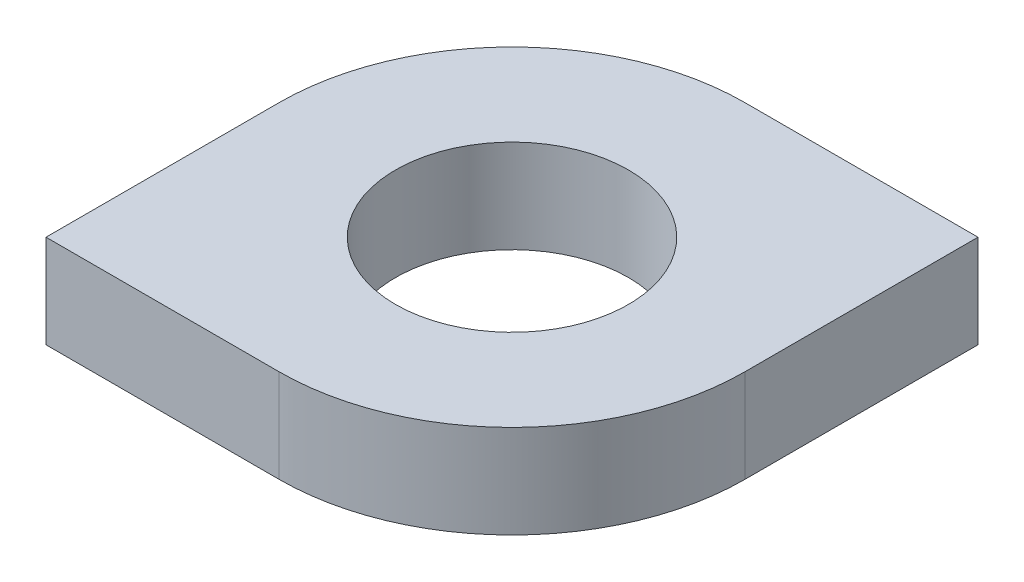
ISO-10303-21;
HEADER;
FILE_DESCRIPTION(('STEP AP214'),'2;1');
FILE_NAME('part.step','',(''),(''),'','','');
FILE_SCHEMA(('AUTOMOTIVE_DESIGN { 1 0 10303 214 1 1 1 1 }'));
ENDSEC;
DATA;
#1=APPLICATION_CONTEXT('core data for automotive mechanical design processes');
#2=APPLICATION_PROTOCOL_DEFINITION('international standard','automotive_design',2000,#1);
#3=PRODUCT_CONTEXT('',#1,'mechanical');
#4=PRODUCT('Part','Part','',(#3));
#5=PRODUCT_RELATED_PRODUCT_CATEGORY('part','',(#4));
#6=PRODUCT_DEFINITION_FORMATION('','',#4);
#7=PRODUCT_DEFINITION_CONTEXT('part definition',#1,'design');
#8=PRODUCT_DEFINITION('design','',#6,#7);
#9=PRODUCT_DEFINITION_SHAPE('','',#8);
#10=(LENGTH_UNIT() NAMED_UNIT(*) SI_UNIT(.MILLI.,.METRE.));
#11=(NAMED_UNIT(*) PLANE_ANGLE_UNIT() SI_UNIT($,.RADIAN.));
#12=(NAMED_UNIT(*) SI_UNIT($,.STERADIAN.) SOLID_ANGLE_UNIT());
#13=UNCERTAINTY_MEASURE_WITH_UNIT(LENGTH_MEASURE(1.E-05),#10,'distance_accuracy_value','');
#14=(GEOMETRIC_REPRESENTATION_CONTEXT(3) GLOBAL_UNCERTAINTY_ASSIGNED_CONTEXT((#13)) GLOBAL_UNIT_ASSIGNED_CONTEXT((#10,
#11,#12)) REPRESENTATION_CONTEXT('',''));
#15=CARTESIAN_POINT('',(0.,0.,0.));
#16=DIRECTION('',(0.,0.,1.));
#17=DIRECTION('',(1.,0.,0.));
#18=AXIS2_PLACEMENT_3D('',#15,#16,#17);
#19=CARTESIAN_POINT('',(0.,4.,-9.99999999999993));
#20=DIRECTION('',(1.,0.,0.));
#21=DIRECTION('',(0.,0.,-1.));
#22=AXIS2_PLACEMENT_3D('',#19,#20,#21);
#23=PLANE('',#22);
#24=DIRECTION('',(0.,0.,1.));
#25=VECTOR('',#24,1.);
#26=CARTESIAN_POINT('',(0.,0.,-9.99999999999993));
#27=LINE('',#26,#25);
#28=CARTESIAN_POINT('',(0.,0.,-9.99999999999993));
#29=VERTEX_POINT('',#28);
#30=CARTESIAN_POINT('',(0.,0.,0.));
#31=VERTEX_POINT('',#30);
#32=EDGE_CURVE('E118',#29,#31,#27,.T.);
#33=ORIENTED_EDGE('',*,*,#32,.T.);
#34=DIRECTION('',(0.,-1.,0.));
#35=VECTOR('',#34,1.);
#36=CARTESIAN_POINT('',(0.,4.,0.));
#37=LINE('',#36,#35);
#38=CARTESIAN_POINT('',(0.,4.,0.));
#39=VERTEX_POINT('',#38);
#40=EDGE_CURVE('E11',#39,#31,#37,.T.);
#41=ORIENTED_EDGE('',*,*,#40,.F.);
#42=DIRECTION('',(0.,0.,1.));
#43=VECTOR('',#42,1.);
#44=CARTESIAN_POINT('',(0.,4.,-9.99999999999993));
#45=LINE('',#44,#43);
#46=CARTESIAN_POINT('',(0.,4.,-9.99999999999993));
#47=VERTEX_POINT('',#46);
#48=EDGE_CURVE('E129',#47,#39,#45,.T.);
#49=ORIENTED_EDGE('',*,*,#48,.F.);
#50=DIRECTION('',(0.,-1.,0.));
#51=VECTOR('',#50,1.);
#52=CARTESIAN_POINT('',(0.,4.,-9.99999999999993));
#53=LINE('',#52,#51);
#54=EDGE_CURVE('E114',#47,#29,#53,.T.);
#55=ORIENTED_EDGE('',*,*,#54,.T.);
#56=EDGE_LOOP('',(#33,#41,#49,#55));
#57=FACE_BOUND('',#56,.T.);
#58=ADVANCED_FACE('F34',(#57),#23,.F.);
#59=CARTESIAN_POINT('',(0.,4.,0.));
#60=DIRECTION('',(0.,0.,-1.));
#61=DIRECTION('',(-1.,0.,0.));
#62=AXIS2_PLACEMENT_3D('',#59,#60,#61);
#63=PLANE('',#62);
#64=DIRECTION('',(1.,0.,0.));
#65=VECTOR('',#64,1.);
#66=CARTESIAN_POINT('',(0.,0.,0.));
#67=LINE('',#66,#65);
#68=CARTESIAN_POINT('',(9.99999999999993,0.,0.));
#69=VERTEX_POINT('',#68);
#70=EDGE_CURVE('E121',#31,#69,#67,.T.);
#71=ORIENTED_EDGE('',*,*,#70,.T.);
#72=DIRECTION('',(0.,-1.,0.));
#73=VECTOR('',#72,1.);
#74=CARTESIAN_POINT('',(9.99999999999993,4.,0.));
#75=LINE('',#74,#73);
#76=CARTESIAN_POINT('',(9.99999999999993,4.,0.));
#77=VERTEX_POINT('',#76);
#78=EDGE_CURVE('E42',#77,#69,#75,.T.);
#79=ORIENTED_EDGE('',*,*,#78,.F.);
#80=DIRECTION('',(1.,0.,0.));
#81=VECTOR('',#80,1.);
#82=CARTESIAN_POINT('',(0.,4.,0.));
#83=LINE('',#82,#81);
#84=EDGE_CURVE('E87',#39,#77,#83,.T.);
#85=ORIENTED_EDGE('',*,*,#84,.F.);
#86=ORIENTED_EDGE('',*,*,#40,.T.);
#87=EDGE_LOOP('',(#71,#79,#85,#86));
#88=FACE_BOUND('',#87,.T.);
#89=ADVANCED_FACE('F154',(#88),#63,.F.);
#90=CARTESIAN_POINT('',(10.,4.,-10.));
#91=DIRECTION('',(0.,-1.,0.));
#92=DIRECTION('',(0.,0.,-1.));
#93=AXIS2_PLACEMENT_3D('',#90,#91,#92);
#94=CYLINDRICAL_SURFACE('',#93,10.);
#95=CARTESIAN_POINT('',(10.,0.,-10.));
#96=DIRECTION('',(0.,1.,0.));
#97=DIRECTION('',(0.,0.,1.));
#98=AXIS2_PLACEMENT_3D('',#95,#96,#97);
#99=CIRCLE('',#98,10.);
#100=CARTESIAN_POINT('',(20.,0.,-10.0000000000001));
#101=VERTEX_POINT('',#100);
#102=EDGE_CURVE('E124',#69,#101,#99,.T.);
#103=ORIENTED_EDGE('',*,*,#102,.T.);
#104=DIRECTION('',(0.,-1.,0.));
#105=VECTOR('',#104,1.);
#106=CARTESIAN_POINT('',(20.,4.,-10.0000000000001));
#107=LINE('',#106,#105);
#108=CARTESIAN_POINT('',(20.,4.,-10.0000000000001));
#109=VERTEX_POINT('',#108);
#110=EDGE_CURVE('E109',#109,#101,#107,.T.);
#111=ORIENTED_EDGE('',*,*,#110,.F.);
#112=CARTESIAN_POINT('',(10.,4.,-10.));
#113=DIRECTION('',(0.,1.,0.));
#114=DIRECTION('',(0.,0.,1.));
#115=AXIS2_PLACEMENT_3D('',#112,#113,#114);
#116=CIRCLE('',#115,10.);
#117=EDGE_CURVE('E100',#77,#109,#116,.T.);
#118=ORIENTED_EDGE('',*,*,#117,.F.);
#119=ORIENTED_EDGE('',*,*,#78,.T.);
#120=EDGE_LOOP('',(#103,#111,#118,#119));
#121=FACE_BOUND('',#120,.T.);
#122=ADVANCED_FACE('F135',(#121),#94,.T.);
#123=CARTESIAN_POINT('',(20.,4.,-10.0000000000001));
#124=DIRECTION('',(-1.,0.,0.));
#125=DIRECTION('',(0.,0.,1.));
#126=AXIS2_PLACEMENT_3D('',#123,#124,#125);
#127=PLANE('',#126);
#128=DIRECTION('',(0.,0.,-1.));
#129=VECTOR('',#128,1.);
#130=CARTESIAN_POINT('',(20.,0.,-10.0000000000001));
#131=LINE('',#130,#129);
#132=CARTESIAN_POINT('',(20.,0.,-20.));
#133=VERTEX_POINT('',#132);
#134=EDGE_CURVE('E108',#101,#133,#131,.T.);
#135=ORIENTED_EDGE('',*,*,#134,.T.);
#136=DIRECTION('',(0.,-1.,0.));
#137=VECTOR('',#136,1.);
#138=CARTESIAN_POINT('',(20.,4.,-20.));
#139=LINE('',#138,#137);
#140=CARTESIAN_POINT('',(20.,4.,-20.));
#141=VERTEX_POINT('',#140);
#142=EDGE_CURVE('E105',#141,#133,#139,.T.);
#143=ORIENTED_EDGE('',*,*,#142,.F.);
#144=DIRECTION('',(0.,0.,-1.));
#145=VECTOR('',#144,1.);
#146=CARTESIAN_POINT('',(20.,4.,-10.0000000000001));
#147=LINE('',#146,#145);
#148=EDGE_CURVE('E94',#109,#141,#147,.T.);
#149=ORIENTED_EDGE('',*,*,#148,.F.);
#150=ORIENTED_EDGE('',*,*,#110,.T.);
#151=EDGE_LOOP('',(#135,#143,#149,#150));
#152=FACE_BOUND('',#151,.T.);
#153=ADVANCED_FACE('F106',(#152),#127,.F.);
#154=CARTESIAN_POINT('',(20.,4.,-20.));
#155=DIRECTION('',(0.,0.,1.));
#156=DIRECTION('',(1.,0.,0.));
#157=AXIS2_PLACEMENT_3D('',#154,#155,#156);
#158=PLANE('',#157);
#159=DIRECTION('',(-1.,0.,0.));
#160=VECTOR('',#159,1.);
#161=CARTESIAN_POINT('',(20.,0.,-20.));
#162=LINE('',#161,#160);
#163=CARTESIAN_POINT('',(10.0000000000001,0.,-20.));
#164=VERTEX_POINT('',#163);
#165=EDGE_CURVE('E73',#133,#164,#162,.T.);
#166=ORIENTED_EDGE('',*,*,#165,.T.);
#167=DIRECTION('',(0.,-1.,0.));
#168=VECTOR('',#167,1.);
#169=CARTESIAN_POINT('',(10.0000000000001,4.,-20.));
#170=LINE('',#169,#168);
#171=CARTESIAN_POINT('',(10.0000000000001,4.,-20.));
#172=VERTEX_POINT('',#171);
#173=EDGE_CURVE('E110',#172,#164,#170,.T.);
#174=ORIENTED_EDGE('',*,*,#173,.F.);
#175=DIRECTION('',(-1.,0.,0.));
#176=VECTOR('',#175,1.);
#177=CARTESIAN_POINT('',(20.,4.,-20.));
#178=LINE('',#177,#176);
#179=EDGE_CURVE('E98',#141,#172,#178,.T.);
#180=ORIENTED_EDGE('',*,*,#179,.F.);
#181=ORIENTED_EDGE('',*,*,#142,.T.);
#182=EDGE_LOOP('',(#166,#174,#180,#181));
#183=FACE_BOUND('',#182,.T.);
#184=ADVANCED_FACE('F112',(#183),#158,.F.);
#185=CARTESIAN_POINT('',(10.,4.,-10.));
#186=DIRECTION('',(0.,-1.,0.));
#187=DIRECTION('',(0.,0.,-1.));
#188=AXIS2_PLACEMENT_3D('',#185,#186,#187);
#189=CYLINDRICAL_SURFACE('',#188,10.);
#190=CARTESIAN_POINT('',(10.,0.,-10.));
#191=DIRECTION('',(0.,1.,0.));
#192=DIRECTION('',(0.,0.,1.));
#193=AXIS2_PLACEMENT_3D('',#190,#191,#192);
#194=CIRCLE('',#193,10.);
#195=EDGE_CURVE('E79',#164,#29,#194,.T.);
#196=ORIENTED_EDGE('',*,*,#195,.T.);
#197=ORIENTED_EDGE('',*,*,#54,.F.);
#198=CARTESIAN_POINT('',(10.,4.,-10.));
#199=DIRECTION('',(0.,1.,0.));
#200=DIRECTION('',(0.,0.,1.));
#201=AXIS2_PLACEMENT_3D('',#198,#199,#200);
#202=CIRCLE('',#201,10.);
#203=EDGE_CURVE('E50',#172,#47,#202,.T.);
#204=ORIENTED_EDGE('',*,*,#203,.F.);
#205=ORIENTED_EDGE('',*,*,#173,.T.);
#206=EDGE_LOOP('',(#196,#197,#204,#205));
#207=FACE_BOUND('',#206,.T.);
#208=ADVANCED_FACE('F142',(#207),#189,.T.);
#209=CARTESIAN_POINT('',(10.,4.,-10.));
#210=DIRECTION('',(0.,1.,0.));
#211=DIRECTION('',(0.,0.,1.));
#212=AXIS2_PLACEMENT_3D('',#209,#210,#211);
#213=PLANE('',#212);
#214=CARTESIAN_POINT('',(10.,4.,-10.));
#215=DIRECTION('',(0.,1.,0.));
#216=DIRECTION('',(0.,0.,1.));
#217=AXIS2_PLACEMENT_3D('',#214,#215,#216);
#218=CIRCLE('',#217,4.99999999999983);
#219=CARTESIAN_POINT('',(10.,4.,-5.00000000000017));
#220=VERTEX_POINT('',#219);
#221=EDGE_CURVE('E209',#220,#220,#218,.T.);
#222=ORIENTED_EDGE('',*,*,#221,.F.);
#223=EDGE_LOOP('',(#222));
#224=FACE_BOUND('',#223,.T.);
#225=ORIENTED_EDGE('',*,*,#48,.T.);
#226=ORIENTED_EDGE('',*,*,#84,.T.);
#227=ORIENTED_EDGE('',*,*,#117,.T.);
#228=ORIENTED_EDGE('',*,*,#148,.T.);
#229=ORIENTED_EDGE('',*,*,#179,.T.);
#230=ORIENTED_EDGE('',*,*,#203,.T.);
#231=EDGE_LOOP('',(#225,#226,#227,#228,#229,#230));
#232=FACE_BOUND('',#231,.T.);
#233=ADVANCED_FACE('F96',(#224,#232),#213,.T.);
#234=CARTESIAN_POINT('',(10.,0.,-10.));
#235=DIRECTION('',(0.,1.,0.));
#236=DIRECTION('',(0.,0.,1.));
#237=AXIS2_PLACEMENT_3D('',#234,#235,#236);
#238=PLANE('',#237);
#239=CARTESIAN_POINT('',(10.,0.,-10.));
#240=DIRECTION('',(0.,1.,0.));
#241=DIRECTION('',(0.,0.,1.));
#242=AXIS2_PLACEMENT_3D('',#239,#240,#241);
#243=CIRCLE('',#242,4.99999999999983);
#244=CARTESIAN_POINT('',(10.,0.,-5.00000000000017));
#245=VERTEX_POINT('',#244);
#246=EDGE_CURVE('E122',#245,#245,#243,.T.);
#247=ORIENTED_EDGE('',*,*,#246,.T.);
#248=EDGE_LOOP('',(#247));
#249=FACE_BOUND('',#248,.T.);
#250=ORIENTED_EDGE('',*,*,#32,.F.);
#251=ORIENTED_EDGE('',*,*,#195,.F.);
#252=ORIENTED_EDGE('',*,*,#165,.F.);
#253=ORIENTED_EDGE('',*,*,#134,.F.);
#254=ORIENTED_EDGE('',*,*,#102,.F.);
#255=ORIENTED_EDGE('',*,*,#70,.F.);
#256=EDGE_LOOP('',(#250,#251,#252,#253,#254,#255));
#257=FACE_BOUND('',#256,.T.);
#258=ADVANCED_FACE('F138',(#249,#257),#238,.F.);
#259=CARTESIAN_POINT('',(10.,0.,-10.));
#260=DIRECTION('',(0.,1.,0.));
#261=DIRECTION('',(0.,0.,1.));
#262=AXIS2_PLACEMENT_3D('',#259,#260,#261);
#263=CYLINDRICAL_SURFACE('',#262,4.99999999999983);
#264=ORIENTED_EDGE('',*,*,#246,.F.);
#265=EDGE_LOOP('',(#264));
#266=FACE_BOUND('',#265,.T.);
#267=ORIENTED_EDGE('',*,*,#221,.T.);
#268=EDGE_LOOP('',(#267));
#269=FACE_BOUND('',#268,.T.);
#270=ADVANCED_FACE('F191',(#266,#269),#263,.F.);
#271=CLOSED_SHELL('',(#58,#89,#122,#153,#184,#208,#233,#258,#270));
#272=MANIFOLD_SOLID_BREP('B2',#271);
#273=ADVANCED_BREP_SHAPE_REPRESENTATION('',(#18,#272),#14);
#274=SHAPE_DEFINITION_REPRESENTATION(#9,#273);
ENDSEC;
END-ISO-10303-21;
